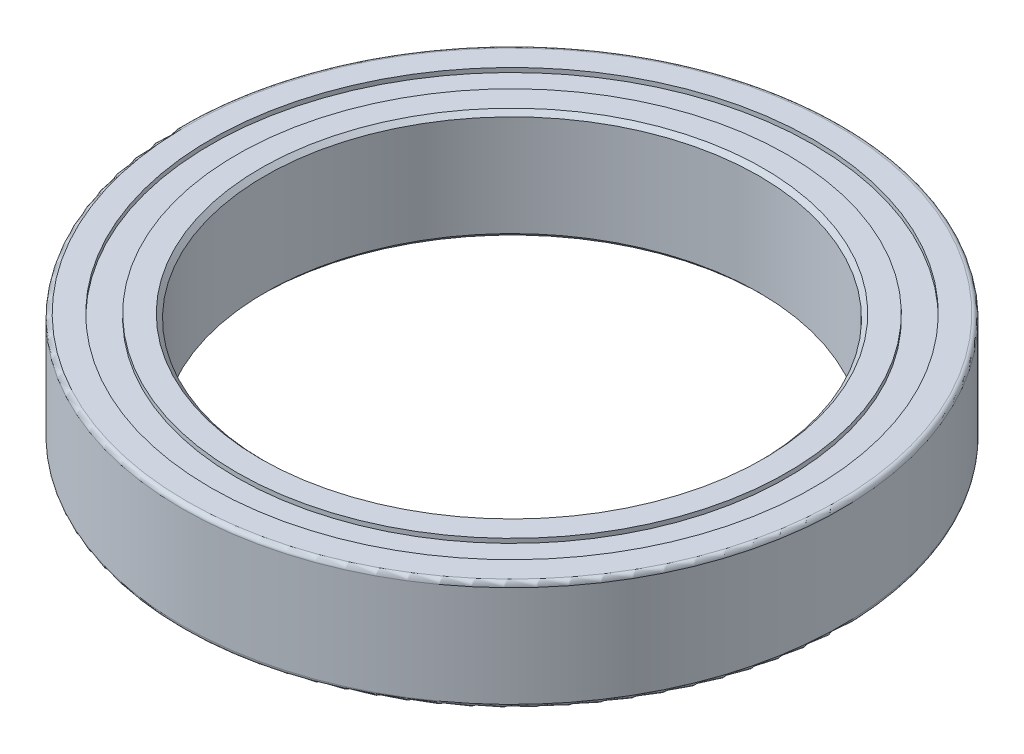
ISO-10303-21;
HEADER;
FILE_DESCRIPTION(('STEP AP214'),'2;1');
FILE_NAME('part.step','',(''),(''),'','','');
FILE_SCHEMA(('AUTOMOTIVE_DESIGN { 1 0 10303 214 1 1 1 1 }'));
ENDSEC;
DATA;
#1=APPLICATION_CONTEXT('core data for automotive mechanical design processes');
#2=APPLICATION_PROTOCOL_DEFINITION('international standard','automotive_design',2000,#1);
#3=PRODUCT_CONTEXT('',#1,'mechanical');
#4=PRODUCT('Part','Part','',(#3));
#5=PRODUCT_RELATED_PRODUCT_CATEGORY('part','',(#4));
#6=PRODUCT_DEFINITION_FORMATION('','',#4);
#7=PRODUCT_DEFINITION_CONTEXT('part definition',#1,'design');
#8=PRODUCT_DEFINITION('design','',#6,#7);
#9=PRODUCT_DEFINITION_SHAPE('','',#8);
#10=(LENGTH_UNIT() NAMED_UNIT(*) SI_UNIT(.MILLI.,.METRE.));
#11=(NAMED_UNIT(*) PLANE_ANGLE_UNIT() SI_UNIT($,.RADIAN.));
#12=(NAMED_UNIT(*) SI_UNIT($,.STERADIAN.) SOLID_ANGLE_UNIT());
#13=UNCERTAINTY_MEASURE_WITH_UNIT(LENGTH_MEASURE(1.E-05),#10,'distance_accuracy_value','');
#14=(GEOMETRIC_REPRESENTATION_CONTEXT(3) GLOBAL_UNCERTAINTY_ASSIGNED_CONTEXT((#13)) GLOBAL_UNIT_ASSIGNED_CONTEXT((#10,
#11,#12)) REPRESENTATION_CONTEXT('',''));
#15=CARTESIAN_POINT('',(0.,0.,0.));
#16=DIRECTION('',(0.,0.,1.));
#17=DIRECTION('',(1.,0.,0.));
#18=AXIS2_PLACEMENT_3D('',#15,#16,#17);
#19=CARTESIAN_POINT('',(0.,1.5875,0.));
#20=DIRECTION('',(0.,-1.,0.));
#21=DIRECTION('',(0.,0.,-1.));
#22=AXIS2_PLACEMENT_3D('',#19,#20,#21);
#23=CYLINDRICAL_SURFACE('',#22,8.7122);
#24=CARTESIAN_POINT('',(0.,-1.5875,0.));
#25=DIRECTION('',(0.,1.,0.));
#26=DIRECTION('',(0.,0.,1.));
#27=AXIS2_PLACEMENT_3D('',#24,#25,#26);
#28=CIRCLE('',#27,8.7122);
#29=CARTESIAN_POINT('',(0.,-1.5875,8.7122));
#30=VERTEX_POINT('',#29);
#31=EDGE_CURVE('E64',#30,#30,#28,.T.);
#32=ORIENTED_EDGE('',*,*,#31,.F.);
#33=EDGE_LOOP('',(#32));
#34=FACE_BOUND('',#33,.T.);
#35=CARTESIAN_POINT('',(0.,-1.4605,0.));
#36=DIRECTION('',(0.,1.,0.));
#37=DIRECTION('',(0.,0.,1.));
#38=AXIS2_PLACEMENT_3D('',#35,#36,#37);
#39=CIRCLE('',#38,8.7122);
#40=CARTESIAN_POINT('',(0.,-1.4605,8.7122));
#41=VERTEX_POINT('',#40);
#42=EDGE_CURVE('E67',#41,#41,#39,.T.);
#43=ORIENTED_EDGE('',*,*,#42,.T.);
#44=EDGE_LOOP('',(#43));
#45=FACE_BOUND('',#44,.T.);
#46=ADVANCED_FACE('F40',(#34,#45),#23,.F.);
#47=CARTESIAN_POINT('',(0.,1.4605,0.));
#48=DIRECTION('',(0.,1.,0.));
#49=DIRECTION('',(0.,0.,1.));
#50=AXIS2_PLACEMENT_3D('',#47,#48,#49);
#51=CIRCLE('',#50,8.7122);
#52=CARTESIAN_POINT('',(0.,1.4605,8.7122));
#53=VERTEX_POINT('',#52);
#54=EDGE_CURVE('E11',#53,#53,#51,.T.);
#55=ORIENTED_EDGE('',*,*,#54,.F.);
#56=EDGE_LOOP('',(#55));
#57=FACE_BOUND('',#56,.T.);
#58=CARTESIAN_POINT('',(0.,1.5875,0.));
#59=DIRECTION('',(0.,1.,0.));
#60=DIRECTION('',(0.,0.,1.));
#61=AXIS2_PLACEMENT_3D('',#58,#59,#60);
#62=CIRCLE('',#61,8.7122);
#63=CARTESIAN_POINT('',(0.,1.5875,8.7122));
#64=VERTEX_POINT('',#63);
#65=EDGE_CURVE('E63',#64,#64,#62,.T.);
#66=ORIENTED_EDGE('',*,*,#65,.T.);
#67=EDGE_LOOP('',(#66));
#68=FACE_BOUND('',#67,.T.);
#69=ADVANCED_FACE('F119',(#57,#68),#23,.F.);
#70=CARTESIAN_POINT('',(0.,1.5875,0.));
#71=DIRECTION('',(0.,-1.,0.));
#72=DIRECTION('',(0.,0.,-1.));
#73=AXIS2_PLACEMENT_3D('',#70,#71,#72);
#74=CYLINDRICAL_SURFACE('',#73,9.525);
#75=CARTESIAN_POINT('',(0.,-1.4605,0.));
#76=DIRECTION('',(0.,1.,0.));
#77=DIRECTION('',(0.,0.,1.));
#78=AXIS2_PLACEMENT_3D('',#75,#76,#77);
#79=CIRCLE('',#78,9.525);
#80=CARTESIAN_POINT('',(0.,-1.4605,9.525));
#81=VERTEX_POINT('',#80);
#82=EDGE_CURVE('E55',#81,#81,#79,.T.);
#83=ORIENTED_EDGE('',*,*,#82,.T.);
#84=EDGE_LOOP('',(#83));
#85=FACE_BOUND('',#84,.T.);
#86=CARTESIAN_POINT('',(0.,1.4605,0.));
#87=DIRECTION('',(0.,1.,0.));
#88=DIRECTION('',(0.,0.,1.));
#89=AXIS2_PLACEMENT_3D('',#86,#87,#88);
#90=CIRCLE('',#89,9.525);
#91=CARTESIAN_POINT('',(0.,1.4605,9.525));
#92=VERTEX_POINT('',#91);
#93=EDGE_CURVE('E60',#92,#92,#90,.F.);
#94=ORIENTED_EDGE('',*,*,#93,.T.);
#95=EDGE_LOOP('',(#94));
#96=FACE_BOUND('',#95,.T.);
#97=ADVANCED_FACE('F125',(#85,#96),#74,.T.);
#98=CARTESIAN_POINT('',(0.,1.5875,0.));
#99=DIRECTION('',(0.,1.,0.));
#100=DIRECTION('',(0.,0.,1.));
#101=AXIS2_PLACEMENT_3D('',#98,#99,#100);
#102=PLANE('',#101);
#103=CARTESIAN_POINT('',(0.,1.5875,0.));
#104=DIRECTION('',(0.,1.,0.));
#105=DIRECTION('',(0.,0.,1.));
#106=AXIS2_PLACEMENT_3D('',#103,#104,#105);
#107=CIRCLE('',#106,9.398);
#108=CARTESIAN_POINT('',(0.,1.5875,9.398));
#109=VERTEX_POINT('',#108);
#110=EDGE_CURVE('E47',#109,#109,#107,.T.);
#111=ORIENTED_EDGE('',*,*,#110,.T.);
#112=EDGE_LOOP('',(#111));
#113=FACE_BOUND('',#112,.T.);
#114=ORIENTED_EDGE('',*,*,#65,.F.);
#115=EDGE_LOOP('',(#114));
#116=FACE_BOUND('',#115,.T.);
#117=ADVANCED_FACE('F141',(#113,#116),#102,.T.);
#118=CARTESIAN_POINT('',(0.,-1.5875,0.));
#119=DIRECTION('',(0.,1.,0.));
#120=DIRECTION('',(0.,0.,1.));
#121=AXIS2_PLACEMENT_3D('',#118,#119,#120);
#122=PLANE('',#121);
#123=CARTESIAN_POINT('',(0.,-1.5875,0.));
#124=DIRECTION('',(0.,1.,0.));
#125=DIRECTION('',(0.,0.,1.));
#126=AXIS2_PLACEMENT_3D('',#123,#124,#125);
#127=CIRCLE('',#126,9.398);
#128=CARTESIAN_POINT('',(0.,-1.5875,9.398));
#129=VERTEX_POINT('',#128);
#130=EDGE_CURVE('E51',#129,#129,#127,.F.);
#131=ORIENTED_EDGE('',*,*,#130,.T.);
#132=EDGE_LOOP('',(#131));
#133=FACE_BOUND('',#132,.T.);
#134=ORIENTED_EDGE('',*,*,#31,.T.);
#135=EDGE_LOOP('',(#134));
#136=FACE_BOUND('',#135,.T.);
#137=ADVANCED_FACE('F133',(#133,#136),#122,.F.);
#138=CARTESIAN_POINT('',(0.,-1.4605,0.));
#139=DIRECTION('',(0.,1.,0.));
#140=DIRECTION('',(0.,0.,1.));
#141=AXIS2_PLACEMENT_3D('',#138,#139,#140);
#142=TOROIDAL_SURFACE('',#141,9.398,0.127);
#143=ORIENTED_EDGE('',*,*,#130,.F.);
#144=EDGE_LOOP('',(#143));
#145=FACE_BOUND('',#144,.T.);
#146=ORIENTED_EDGE('',*,*,#82,.F.);
#147=EDGE_LOOP('',(#146));
#148=FACE_BOUND('',#147,.T.);
#149=ADVANCED_FACE('F131',(#145,#148),#142,.T.);
#150=CARTESIAN_POINT('',(0.,1.4605,0.));
#151=DIRECTION('',(0.,1.,0.));
#152=DIRECTION('',(0.,0.,1.));
#153=AXIS2_PLACEMENT_3D('',#150,#151,#152);
#154=TOROIDAL_SURFACE('',#153,9.398,0.127);
#155=ORIENTED_EDGE('',*,*,#93,.F.);
#156=EDGE_LOOP('',(#155));
#157=FACE_BOUND('',#156,.T.);
#158=ORIENTED_EDGE('',*,*,#110,.F.);
#159=EDGE_LOOP('',(#158));
#160=FACE_BOUND('',#159,.T.);
#161=ADVANCED_FACE('F42',(#157,#160),#154,.T.);
#162=CARTESIAN_POINT('',(0.,1.4605,0.));
#163=DIRECTION('',(0.,1.,0.));
#164=DIRECTION('',(0.,0.,1.));
#165=AXIS2_PLACEMENT_3D('',#162,#163,#164);
#166=PLANE('',#165);
#167=ORIENTED_EDGE('',*,*,#54,.T.);
#168=EDGE_LOOP('',(#167));
#169=FACE_BOUND('',#168,.T.);
#170=CARTESIAN_POINT('',(0.,1.4605,0.));
#171=DIRECTION('',(0.,1.,0.));
#172=DIRECTION('',(0.,0.,1.));
#173=AXIS2_PLACEMENT_3D('',#170,#171,#172);
#174=CIRCLE('',#173,7.95655);
#175=CARTESIAN_POINT('',(0.,1.4605,7.95655));
#176=VERTEX_POINT('',#175);
#177=EDGE_CURVE('E72',#176,#176,#174,.T.);
#178=ORIENTED_EDGE('',*,*,#177,.F.);
#179=EDGE_LOOP('',(#178));
#180=FACE_BOUND('',#179,.T.);
#181=ADVANCED_FACE('F139',(#169,#180),#166,.T.);
#182=CARTESIAN_POINT('',(0.,-1.4605,0.));
#183=DIRECTION('',(0.,1.,0.));
#184=DIRECTION('',(0.,0.,1.));
#185=AXIS2_PLACEMENT_3D('',#182,#183,#184);
#186=PLANE('',#185);
#187=ORIENTED_EDGE('',*,*,#42,.F.);
#188=EDGE_LOOP('',(#187));
#189=FACE_BOUND('',#188,.T.);
#190=CARTESIAN_POINT('',(0.,-1.4605,0.));
#191=DIRECTION('',(0.,1.,0.));
#192=DIRECTION('',(0.,0.,1.));
#193=AXIS2_PLACEMENT_3D('',#190,#191,#192);
#194=CIRCLE('',#193,7.95655);
#195=CARTESIAN_POINT('',(0.,-1.4605,7.95655));
#196=VERTEX_POINT('',#195);
#197=EDGE_CURVE('E75',#196,#196,#194,.F.);
#198=ORIENTED_EDGE('',*,*,#197,.F.);
#199=EDGE_LOOP('',(#198));
#200=FACE_BOUND('',#199,.T.);
#201=ADVANCED_FACE('F116',(#189,#200),#186,.F.);
#202=CARTESIAN_POINT('',(0.,1.5875,0.));
#203=DIRECTION('',(0.,-1.,0.));
#204=DIRECTION('',(0.,0.,-1.));
#205=AXIS2_PLACEMENT_3D('',#202,#203,#204);
#206=CYLINDRICAL_SURFACE('',#205,7.95655);
#207=CARTESIAN_POINT('',(0.,-1.5875,0.));
#208=DIRECTION('',(0.,1.,0.));
#209=DIRECTION('',(0.,0.,1.));
#210=AXIS2_PLACEMENT_3D('',#207,#208,#209);
#211=CIRCLE('',#210,7.95655);
#212=CARTESIAN_POINT('',(0.,-1.5875,7.95655));
#213=VERTEX_POINT('',#212);
#214=EDGE_CURVE('E91',#213,#213,#211,.T.);
#215=ORIENTED_EDGE('',*,*,#214,.T.);
#216=EDGE_LOOP('',(#215));
#217=FACE_BOUND('',#216,.T.);
#218=ORIENTED_EDGE('',*,*,#197,.T.);
#219=EDGE_LOOP('',(#218));
#220=FACE_BOUND('',#219,.T.);
#221=ADVANCED_FACE('F104',(#217,#220),#206,.T.);
#222=CARTESIAN_POINT('',(0.,1.5875,0.));
#223=DIRECTION('',(0.,-1.,0.));
#224=DIRECTION('',(0.,0.,-1.));
#225=AXIS2_PLACEMENT_3D('',#222,#223,#224);
#226=CYLINDRICAL_SURFACE('',#225,7.14375);
#227=CARTESIAN_POINT('',(0.,-1.4605,0.));
#228=DIRECTION('',(0.,1.,0.));
#229=DIRECTION('',(0.,0.,1.));
#230=AXIS2_PLACEMENT_3D('',#227,#228,#229);
#231=CIRCLE('',#230,7.14375);
#232=CARTESIAN_POINT('',(0.,-1.4605,7.14375));
#233=VERTEX_POINT('',#232);
#234=EDGE_CURVE('E81',#233,#233,#231,.F.);
#235=ORIENTED_EDGE('',*,*,#234,.T.);
#236=EDGE_LOOP('',(#235));
#237=FACE_BOUND('',#236,.T.);
#238=CARTESIAN_POINT('',(0.,1.4605,0.));
#239=DIRECTION('',(0.,1.,0.));
#240=DIRECTION('',(0.,0.,1.));
#241=AXIS2_PLACEMENT_3D('',#238,#239,#240);
#242=CIRCLE('',#241,7.14375);
#243=CARTESIAN_POINT('',(0.,1.4605,7.14375));
#244=VERTEX_POINT('',#243);
#245=EDGE_CURVE('E84',#244,#244,#242,.T.);
#246=ORIENTED_EDGE('',*,*,#245,.T.);
#247=EDGE_LOOP('',(#246));
#248=FACE_BOUND('',#247,.T.);
#249=ADVANCED_FACE('F101',(#237,#248),#226,.F.);
#250=ORIENTED_EDGE('',*,*,#177,.T.);
#251=EDGE_LOOP('',(#250));
#252=FACE_BOUND('',#251,.T.);
#253=CARTESIAN_POINT('',(0.,1.5875,0.));
#254=DIRECTION('',(0.,1.,0.));
#255=DIRECTION('',(0.,0.,1.));
#256=AXIS2_PLACEMENT_3D('',#253,#254,#255);
#257=CIRCLE('',#256,7.95655);
#258=CARTESIAN_POINT('',(0.,1.5875,7.95655));
#259=VERTEX_POINT('',#258);
#260=EDGE_CURVE('E90',#259,#259,#257,.T.);
#261=ORIENTED_EDGE('',*,*,#260,.F.);
#262=EDGE_LOOP('',(#261));
#263=FACE_BOUND('',#262,.T.);
#264=ADVANCED_FACE('F99',(#252,#263),#206,.T.);
#265=CARTESIAN_POINT('',(0.,1.5875,0.));
#266=DIRECTION('',(0.,1.,0.));
#267=DIRECTION('',(0.,0.,1.));
#268=AXIS2_PLACEMENT_3D('',#265,#266,#267);
#269=PLANE('',#268);
#270=CARTESIAN_POINT('',(0.,1.5875,0.));
#271=DIRECTION('',(0.,1.,0.));
#272=DIRECTION('',(0.,0.,1.));
#273=AXIS2_PLACEMENT_3D('',#270,#271,#272);
#274=CIRCLE('',#273,7.27075);
#275=CARTESIAN_POINT('',(0.,1.5875,7.27075));
#276=VERTEX_POINT('',#275);
#277=EDGE_CURVE('E78',#276,#276,#274,.F.);
#278=ORIENTED_EDGE('',*,*,#277,.T.);
#279=EDGE_LOOP('',(#278));
#280=FACE_BOUND('',#279,.T.);
#281=ORIENTED_EDGE('',*,*,#260,.T.);
#282=EDGE_LOOP('',(#281));
#283=FACE_BOUND('',#282,.T.);
#284=ADVANCED_FACE('F97',(#280,#283),#269,.T.);
#285=CARTESIAN_POINT('',(0.,-1.5875,0.));
#286=DIRECTION('',(0.,1.,0.));
#287=DIRECTION('',(0.,0.,1.));
#288=AXIS2_PLACEMENT_3D('',#285,#286,#287);
#289=PLANE('',#288);
#290=CARTESIAN_POINT('',(0.,-1.5875,0.));
#291=DIRECTION('',(0.,1.,0.));
#292=DIRECTION('',(0.,0.,1.));
#293=AXIS2_PLACEMENT_3D('',#290,#291,#292);
#294=CIRCLE('',#293,7.27075);
#295=CARTESIAN_POINT('',(0.,-1.5875,7.27075));
#296=VERTEX_POINT('',#295);
#297=EDGE_CURVE('E87',#296,#296,#294,.T.);
#298=ORIENTED_EDGE('',*,*,#297,.T.);
#299=EDGE_LOOP('',(#298));
#300=FACE_BOUND('',#299,.T.);
#301=ORIENTED_EDGE('',*,*,#214,.F.);
#302=EDGE_LOOP('',(#301));
#303=FACE_BOUND('',#302,.T.);
#304=ADVANCED_FACE('F109',(#300,#303),#289,.F.);
#305=CARTESIAN_POINT('',(0.,-1.5875,0.));
#306=DIRECTION('',(0.,-1.,0.));
#307=DIRECTION('',(0.,0.,-1.));
#308=AXIS2_PLACEMENT_3D('',#305,#306,#307);
#309=CONICAL_SURFACE('',#308,7.27075,0.785398163397448);
#310=ORIENTED_EDGE('',*,*,#234,.F.);
#311=EDGE_LOOP('',(#310));
#312=FACE_BOUND('',#311,.T.);
#313=ORIENTED_EDGE('',*,*,#297,.F.);
#314=EDGE_LOOP('',(#313));
#315=FACE_BOUND('',#314,.T.);
#316=ADVANCED_FACE('F167',(#312,#315),#309,.F.);
#317=CARTESIAN_POINT('',(0.,1.4605,0.));
#318=DIRECTION('',(0.,1.,0.));
#319=DIRECTION('',(0.,0.,1.));
#320=AXIS2_PLACEMENT_3D('',#317,#318,#319);
#321=CONICAL_SURFACE('',#320,7.14375,0.785398163397448);
#322=ORIENTED_EDGE('',*,*,#277,.F.);
#323=EDGE_LOOP('',(#322));
#324=FACE_BOUND('',#323,.T.);
#325=ORIENTED_EDGE('',*,*,#245,.F.);
#326=EDGE_LOOP('',(#325));
#327=FACE_BOUND('',#326,.T.);
#328=ADVANCED_FACE('F164',(#324,#327),#321,.F.);
#329=CLOSED_SHELL('',(#46,#69,#97,#117,#137,#149,#161,#181,#201,#221,#249,#264,#284,#304,#316,#328));
#330=MANIFOLD_SOLID_BREP('B2',#329);
#331=ADVANCED_BREP_SHAPE_REPRESENTATION('',(#18,#330),#14);
#332=SHAPE_DEFINITION_REPRESENTATION(#9,#331);
ENDSEC;
END-ISO-10303-21;
